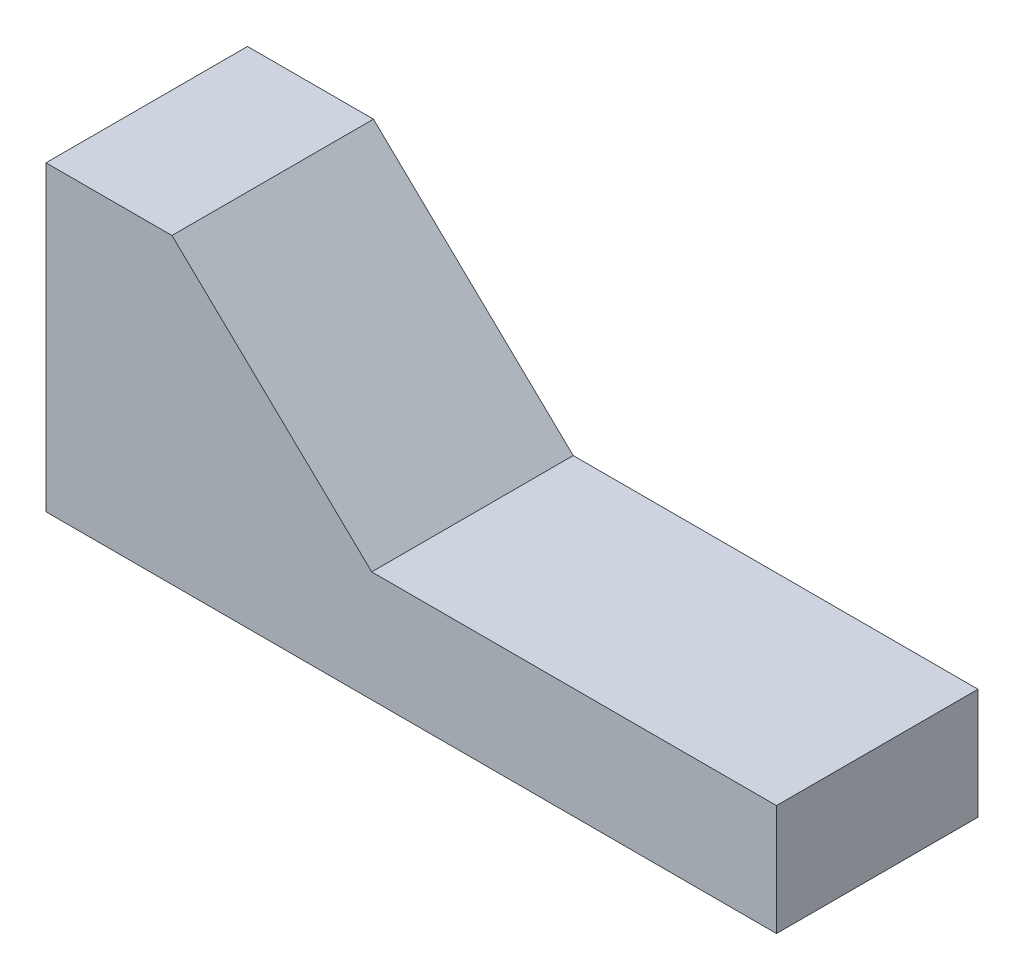
ISO-10303-21;
HEADER;
FILE_DESCRIPTION(('STEP AP214'),'2;1');
FILE_NAME('part.step','',(''),(''),'','','');
FILE_SCHEMA(('AUTOMOTIVE_DESIGN { 1 0 10303 214 1 1 1 1 }'));
ENDSEC;
DATA;
#1=APPLICATION_CONTEXT('core data for automotive mechanical design processes');
#2=APPLICATION_PROTOCOL_DEFINITION('international standard','automotive_design',2000,#1);
#3=PRODUCT_CONTEXT('',#1,'mechanical');
#4=PRODUCT('Part','Part','',(#3));
#5=PRODUCT_RELATED_PRODUCT_CATEGORY('part','',(#4));
#6=PRODUCT_DEFINITION_FORMATION('','',#4);
#7=PRODUCT_DEFINITION_CONTEXT('part definition',#1,'design');
#8=PRODUCT_DEFINITION('design','',#6,#7);
#9=PRODUCT_DEFINITION_SHAPE('','',#8);
#10=(LENGTH_UNIT() NAMED_UNIT(*) SI_UNIT(.MILLI.,.METRE.));
#11=(NAMED_UNIT(*) PLANE_ANGLE_UNIT() SI_UNIT($,.RADIAN.));
#12=(NAMED_UNIT(*) SI_UNIT($,.STERADIAN.) SOLID_ANGLE_UNIT());
#13=UNCERTAINTY_MEASURE_WITH_UNIT(LENGTH_MEASURE(1.E-05),#10,'distance_accuracy_value','');
#14=(GEOMETRIC_REPRESENTATION_CONTEXT(3) GLOBAL_UNCERTAINTY_ASSIGNED_CONTEXT((#13)) GLOBAL_UNIT_ASSIGNED_CONTEXT((#10,
#11,#12)) REPRESENTATION_CONTEXT('',''));
#15=CARTESIAN_POINT('',(0.,0.,0.));
#16=DIRECTION('',(0.,0.,1.));
#17=DIRECTION('',(1.,0.,0.));
#18=AXIS2_PLACEMENT_3D('',#15,#16,#17);
#19=CARTESIAN_POINT('',(-72.5,-30.,-20.));
#20=DIRECTION('',(-1.,0.,0.));
#21=DIRECTION('',(0.,-1.,0.));
#22=AXIS2_PLACEMENT_3D('',#19,#20,#21);
#23=PLANE('',#22);
#24=DIRECTION('',(0.,0.,1.));
#25=VECTOR('',#24,1.);
#26=CARTESIAN_POINT('',(-72.5,-30.,-20.));
#27=LINE('',#26,#25);
#28=CARTESIAN_POINT('',(-72.5,-30.,-20.));
#29=VERTEX_POINT('',#28);
#30=CARTESIAN_POINT('',(-72.5,-30.,20.));
#31=VERTEX_POINT('',#30);
#32=EDGE_CURVE('E44',#29,#31,#27,.T.);
#33=ORIENTED_EDGE('',*,*,#32,.T.);
#34=DIRECTION('',(0.,-1.,0.));
#35=VECTOR('',#34,1.);
#36=CARTESIAN_POINT('',(-72.5,-30.,20.));
#37=LINE('',#36,#35);
#38=CARTESIAN_POINT('',(-72.5,30.,20.));
#39=VERTEX_POINT('',#38);
#40=EDGE_CURVE('E93',#39,#31,#37,.T.);
#41=ORIENTED_EDGE('',*,*,#40,.F.);
#42=DIRECTION('',(0.,0.,1.));
#43=VECTOR('',#42,1.);
#44=CARTESIAN_POINT('',(-72.5,30.,-20.));
#45=LINE('',#44,#43);
#46=CARTESIAN_POINT('',(-72.5,30.,-20.));
#47=VERTEX_POINT('',#46);
#48=EDGE_CURVE('E11',#47,#39,#45,.T.);
#49=ORIENTED_EDGE('',*,*,#48,.F.);
#50=DIRECTION('',(0.,-1.,0.));
#51=VECTOR('',#50,1.);
#52=CARTESIAN_POINT('',(-72.5,-30.,-20.));
#53=LINE('',#52,#51);
#54=EDGE_CURVE('E94',#47,#29,#53,.T.);
#55=ORIENTED_EDGE('',*,*,#54,.T.);
#56=EDGE_LOOP('',(#33,#41,#49,#55));
#57=FACE_BOUND('',#56,.T.);
#58=ADVANCED_FACE('F41',(#57),#23,.T.);
#59=CARTESIAN_POINT('',(-72.5,30.,-20.));
#60=DIRECTION('',(0.,1.,0.));
#61=DIRECTION('',(0.,0.,1.));
#62=AXIS2_PLACEMENT_3D('',#59,#60,#61);
#63=PLANE('',#62);
#64=ORIENTED_EDGE('',*,*,#48,.T.);
#65=DIRECTION('',(-1.,0.,0.));
#66=VECTOR('',#65,1.);
#67=CARTESIAN_POINT('',(-72.5,30.,20.));
#68=LINE('',#67,#66);
#69=CARTESIAN_POINT('',(-47.5,30.,20.));
#70=VERTEX_POINT('',#69);
#71=EDGE_CURVE('E111',#70,#39,#68,.T.);
#72=ORIENTED_EDGE('',*,*,#71,.F.);
#73=DIRECTION('',(0.,0.,1.));
#74=VECTOR('',#73,1.);
#75=CARTESIAN_POINT('',(-47.5,30.,-20.));
#76=LINE('',#75,#74);
#77=CARTESIAN_POINT('',(-47.5,30.,-20.));
#78=VERTEX_POINT('',#77);
#79=EDGE_CURVE('E49',#78,#70,#76,.T.);
#80=ORIENTED_EDGE('',*,*,#79,.F.);
#81=DIRECTION('',(-1.,0.,0.));
#82=VECTOR('',#81,1.);
#83=CARTESIAN_POINT('',(-72.5,30.,-20.));
#84=LINE('',#83,#82);
#85=EDGE_CURVE('E99',#78,#47,#84,.T.);
#86=ORIENTED_EDGE('',*,*,#85,.T.);
#87=EDGE_LOOP('',(#64,#72,#80,#86));
#88=FACE_BOUND('',#87,.T.);
#89=ADVANCED_FACE('F151',(#88),#63,.T.);
#90=CARTESIAN_POINT('',(-47.5,30.,-20.));
#91=DIRECTION('',(0.691874837561775,0.722017457648267,0.));
#92=DIRECTION('',(-0.722017457648267,0.691874837561775,0.));
#93=AXIS2_PLACEMENT_3D('',#90,#91,#92);
#94=PLANE('',#93);
#95=ORIENTED_EDGE('',*,*,#79,.T.);
#96=DIRECTION('',(-0.722017457648267,0.691874837561775,0.));
#97=VECTOR('',#96,1.);
#98=CARTESIAN_POINT('',(-47.5,30.,20.));
#99=LINE('',#98,#97);
#100=CARTESIAN_POINT('',(-7.84446998054844,-8.,20.));
#101=VERTEX_POINT('',#100);
#102=EDGE_CURVE('E118',#101,#70,#99,.T.);
#103=ORIENTED_EDGE('',*,*,#102,.F.);
#104=DIRECTION('',(0.,0.,1.));
#105=VECTOR('',#104,1.);
#106=CARTESIAN_POINT('',(-7.84446998054844,-8.,-20.));
#107=LINE('',#106,#105);
#108=CARTESIAN_POINT('',(-7.84446998054844,-8.,-20.));
#109=VERTEX_POINT('',#108);
#110=EDGE_CURVE('E134',#109,#101,#107,.T.);
#111=ORIENTED_EDGE('',*,*,#110,.F.);
#112=DIRECTION('',(-0.722017457648267,0.691874837561775,0.));
#113=VECTOR('',#112,1.);
#114=CARTESIAN_POINT('',(-47.5,30.,-20.));
#115=LINE('',#114,#113);
#116=EDGE_CURVE('E130',#109,#78,#115,.T.);
#117=ORIENTED_EDGE('',*,*,#116,.T.);
#118=EDGE_LOOP('',(#95,#103,#111,#117));
#119=FACE_BOUND('',#118,.T.);
#120=ADVANCED_FACE('F147',(#119),#94,.T.);
#121=CARTESIAN_POINT('',(-7.84446998054844,-8.,-20.));
#122=DIRECTION('',(0.,1.,0.));
#123=DIRECTION('',(0.,0.,1.));
#124=AXIS2_PLACEMENT_3D('',#121,#122,#123);
#125=PLANE('',#124);
#126=ORIENTED_EDGE('',*,*,#110,.T.);
#127=DIRECTION('',(-1.,0.,0.));
#128=VECTOR('',#127,1.);
#129=CARTESIAN_POINT('',(-7.84446998054844,-8.,20.));
#130=LINE('',#129,#128);
#131=CARTESIAN_POINT('',(72.5,-8.,20.));
#132=VERTEX_POINT('',#131);
#133=EDGE_CURVE('E115',#132,#101,#130,.T.);
#134=ORIENTED_EDGE('',*,*,#133,.F.);
#135=DIRECTION('',(0.,0.,1.));
#136=VECTOR('',#135,1.);
#137=CARTESIAN_POINT('',(72.5,-8.,-20.));
#138=LINE('',#137,#136);
#139=CARTESIAN_POINT('',(72.5,-8.,-20.));
#140=VERTEX_POINT('',#139);
#141=EDGE_CURVE('E136',#140,#132,#138,.T.);
#142=ORIENTED_EDGE('',*,*,#141,.F.);
#143=DIRECTION('',(-1.,0.,0.));
#144=VECTOR('',#143,1.);
#145=CARTESIAN_POINT('',(-7.84446998054844,-8.,-20.));
#146=LINE('',#145,#144);
#147=EDGE_CURVE('E127',#140,#109,#146,.T.);
#148=ORIENTED_EDGE('',*,*,#147,.T.);
#149=EDGE_LOOP('',(#126,#134,#142,#148));
#150=FACE_BOUND('',#149,.T.);
#151=ADVANCED_FACE('F144',(#150),#125,.T.);
#152=CARTESIAN_POINT('',(72.5,-8.,-20.));
#153=DIRECTION('',(1.,0.,0.));
#154=DIRECTION('',(0.,0.,-1.));
#155=AXIS2_PLACEMENT_3D('',#152,#153,#154);
#156=PLANE('',#155);
#157=ORIENTED_EDGE('',*,*,#141,.T.);
#158=DIRECTION('',(0.,1.,0.));
#159=VECTOR('',#158,1.);
#160=CARTESIAN_POINT('',(72.5,-8.,20.));
#161=LINE('',#160,#159);
#162=CARTESIAN_POINT('',(72.5,-30.,20.));
#163=VERTEX_POINT('',#162);
#164=EDGE_CURVE('E106',#163,#132,#161,.T.);
#165=ORIENTED_EDGE('',*,*,#164,.F.);
#166=DIRECTION('',(0.,0.,1.));
#167=VECTOR('',#166,1.);
#168=CARTESIAN_POINT('',(72.5,-30.,-20.));
#169=LINE('',#168,#167);
#170=CARTESIAN_POINT('',(72.5,-30.,-20.));
#171=VERTEX_POINT('',#170);
#172=EDGE_CURVE('E98',#171,#163,#169,.T.);
#173=ORIENTED_EDGE('',*,*,#172,.F.);
#174=DIRECTION('',(0.,1.,0.));
#175=VECTOR('',#174,1.);
#176=CARTESIAN_POINT('',(72.5,-8.,-20.));
#177=LINE('',#176,#175);
#178=EDGE_CURVE('E124',#171,#140,#177,.T.);
#179=ORIENTED_EDGE('',*,*,#178,.T.);
#180=EDGE_LOOP('',(#157,#165,#173,#179));
#181=FACE_BOUND('',#180,.T.);
#182=ADVANCED_FACE('F138',(#181),#156,.T.);
#183=CARTESIAN_POINT('',(72.5,-30.,-20.));
#184=DIRECTION('',(0.,-1.,0.));
#185=DIRECTION('',(1.,0.,0.));
#186=AXIS2_PLACEMENT_3D('',#183,#184,#185);
#187=PLANE('',#186);
#188=ORIENTED_EDGE('',*,*,#172,.T.);
#189=DIRECTION('',(1.,0.,0.));
#190=VECTOR('',#189,1.);
#191=CARTESIAN_POINT('',(72.5,-30.,20.));
#192=LINE('',#191,#190);
#193=EDGE_CURVE('E101',#31,#163,#192,.T.);
#194=ORIENTED_EDGE('',*,*,#193,.F.);
#195=ORIENTED_EDGE('',*,*,#32,.F.);
#196=DIRECTION('',(1.,0.,0.));
#197=VECTOR('',#196,1.);
#198=CARTESIAN_POINT('',(72.5,-30.,-20.));
#199=LINE('',#198,#197);
#200=EDGE_CURVE('E122',#29,#171,#199,.T.);
#201=ORIENTED_EDGE('',*,*,#200,.T.);
#202=EDGE_LOOP('',(#188,#194,#195,#201));
#203=FACE_BOUND('',#202,.T.);
#204=ADVANCED_FACE('F102',(#203),#187,.T.);
#205=CARTESIAN_POINT('',(0.,0.,-20.));
#206=DIRECTION('',(0.,0.,-1.));
#207=DIRECTION('',(-1.,0.,0.));
#208=AXIS2_PLACEMENT_3D('',#205,#206,#207);
#209=PLANE('',#208);
#210=ORIENTED_EDGE('',*,*,#54,.F.);
#211=ORIENTED_EDGE('',*,*,#85,.F.);
#212=ORIENTED_EDGE('',*,*,#116,.F.);
#213=ORIENTED_EDGE('',*,*,#147,.F.);
#214=ORIENTED_EDGE('',*,*,#178,.F.);
#215=ORIENTED_EDGE('',*,*,#200,.F.);
#216=EDGE_LOOP('',(#210,#211,#212,#213,#214,#215));
#217=FACE_BOUND('',#216,.T.);
#218=ADVANCED_FACE('F150',(#217),#209,.T.);
#219=CARTESIAN_POINT('',(0.,0.,20.));
#220=DIRECTION('',(0.,0.,-1.));
#221=DIRECTION('',(-1.,0.,0.));
#222=AXIS2_PLACEMENT_3D('',#219,#220,#221);
#223=PLANE('',#222);
#224=ORIENTED_EDGE('',*,*,#40,.T.);
#225=ORIENTED_EDGE('',*,*,#193,.T.);
#226=ORIENTED_EDGE('',*,*,#164,.T.);
#227=ORIENTED_EDGE('',*,*,#133,.T.);
#228=ORIENTED_EDGE('',*,*,#102,.T.);
#229=ORIENTED_EDGE('',*,*,#71,.T.);
#230=EDGE_LOOP('',(#224,#225,#226,#227,#228,#229));
#231=FACE_BOUND('',#230,.T.);
#232=ADVANCED_FACE('F109',(#231),#223,.F.);
#233=CLOSED_SHELL('',(#58,#89,#120,#151,#182,#204,#218,#232));
#234=MANIFOLD_SOLID_BREP('B2',#233);
#235=ADVANCED_BREP_SHAPE_REPRESENTATION('',(#18,#234),#14);
#236=SHAPE_DEFINITION_REPRESENTATION(#9,#235);
ENDSEC;
END-ISO-10303-21;
